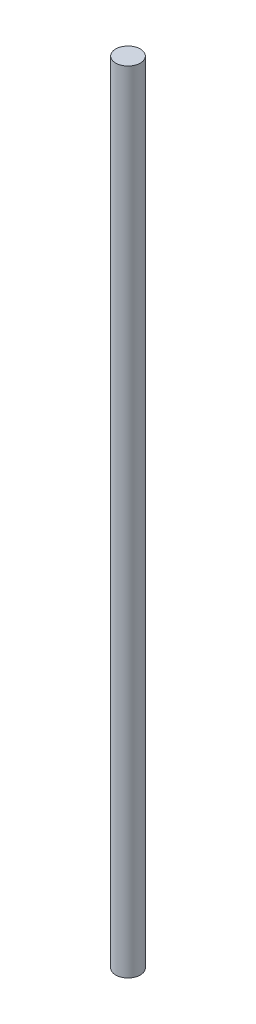
ISO-10303-21;
HEADER;
FILE_DESCRIPTION(('STEP AP214'),'2;1');
FILE_NAME('part.step','',(''),(''),'','','');
FILE_SCHEMA(('AUTOMOTIVE_DESIGN { 1 0 10303 214 1 1 1 1 }'));
ENDSEC;
DATA;
#1=APPLICATION_CONTEXT('core data for automotive mechanical design processes');
#2=APPLICATION_PROTOCOL_DEFINITION('international standard','automotive_design',2000,#1);
#3=PRODUCT_CONTEXT('',#1,'mechanical');
#4=PRODUCT('Part','Part','',(#3));
#5=PRODUCT_RELATED_PRODUCT_CATEGORY('part','',(#4));
#6=PRODUCT_DEFINITION_FORMATION('','',#4);
#7=PRODUCT_DEFINITION_CONTEXT('part definition',#1,'design');
#8=PRODUCT_DEFINITION('design','',#6,#7);
#9=PRODUCT_DEFINITION_SHAPE('','',#8);
#10=(LENGTH_UNIT() NAMED_UNIT(*) SI_UNIT(.MILLI.,.METRE.));
#11=(NAMED_UNIT(*) PLANE_ANGLE_UNIT() SI_UNIT($,.RADIAN.));
#12=(NAMED_UNIT(*) SI_UNIT($,.STERADIAN.) SOLID_ANGLE_UNIT());
#13=UNCERTAINTY_MEASURE_WITH_UNIT(LENGTH_MEASURE(1.E-05),#10,'distance_accuracy_value','');
#14=(GEOMETRIC_REPRESENTATION_CONTEXT(3) GLOBAL_UNCERTAINTY_ASSIGNED_CONTEXT((#13)) GLOBAL_UNIT_ASSIGNED_CONTEXT((#10,
#11,#12)) REPRESENTATION_CONTEXT('',''));
#15=CARTESIAN_POINT('',(0.,0.,0.));
#16=DIRECTION('',(0.,0.,1.));
#17=DIRECTION('',(1.,0.,0.));
#18=AXIS2_PLACEMENT_3D('',#15,#16,#17);
#19=CARTESIAN_POINT('',(0.,193.04,0.));
#20=DIRECTION('',(0.,-1.,0.));
#21=DIRECTION('',(0.,0.,-1.));
#22=AXIS2_PLACEMENT_3D('',#19,#20,#21);
#23=CYLINDRICAL_SURFACE('',#22,3.);
#24=CARTESIAN_POINT('',(0.,193.04,0.));
#25=DIRECTION('',(0.,1.,0.));
#26=DIRECTION('',(0.,0.,1.));
#27=AXIS2_PLACEMENT_3D('',#24,#25,#26);
#28=CIRCLE('',#27,3.);
#29=CARTESIAN_POINT('',(0.,193.04,3.));
#30=VERTEX_POINT('',#29);
#31=EDGE_CURVE('E10',#30,#30,#28,.T.);
#32=ORIENTED_EDGE('',*,*,#31,.F.);
#33=EDGE_LOOP('',(#32));
#34=FACE_BOUND('',#33,.T.);
#35=CARTESIAN_POINT('',(0.,0.,0.));
#36=DIRECTION('',(0.,1.,0.));
#37=DIRECTION('',(0.,0.,1.));
#38=AXIS2_PLACEMENT_3D('',#35,#36,#37);
#39=CIRCLE('',#38,3.);
#40=CARTESIAN_POINT('',(0.,0.,3.));
#41=VERTEX_POINT('',#40);
#42=EDGE_CURVE('E40',#41,#41,#39,.T.);
#43=ORIENTED_EDGE('',*,*,#42,.T.);
#44=EDGE_LOOP('',(#43));
#45=FACE_BOUND('',#44,.T.);
#46=ADVANCED_FACE('F37',(#34,#45),#23,.T.);
#47=CARTESIAN_POINT('',(0.,193.04,0.));
#48=DIRECTION('',(0.,1.,0.));
#49=DIRECTION('',(0.,0.,1.));
#50=AXIS2_PLACEMENT_3D('',#47,#48,#49);
#51=PLANE('',#50);
#52=ORIENTED_EDGE('',*,*,#31,.T.);
#53=EDGE_LOOP('',(#52));
#54=FACE_BOUND('',#53,.T.);
#55=ADVANCED_FACE('F52',(#54),#51,.T.);
#56=CARTESIAN_POINT('',(0.,0.,0.));
#57=DIRECTION('',(0.,1.,0.));
#58=DIRECTION('',(0.,0.,1.));
#59=AXIS2_PLACEMENT_3D('',#56,#57,#58);
#60=PLANE('',#59);
#61=ORIENTED_EDGE('',*,*,#42,.F.);
#62=EDGE_LOOP('',(#61));
#63=FACE_BOUND('',#62,.T.);
#64=ADVANCED_FACE('F50',(#63),#60,.F.);
#65=CLOSED_SHELL('',(#46,#55,#64));
#66=MANIFOLD_SOLID_BREP('B2',#65);
#67=ADVANCED_BREP_SHAPE_REPRESENTATION('',(#18,#66),#14);
#68=SHAPE_DEFINITION_REPRESENTATION(#9,#67);
ENDSEC;
END-ISO-10303-21;
